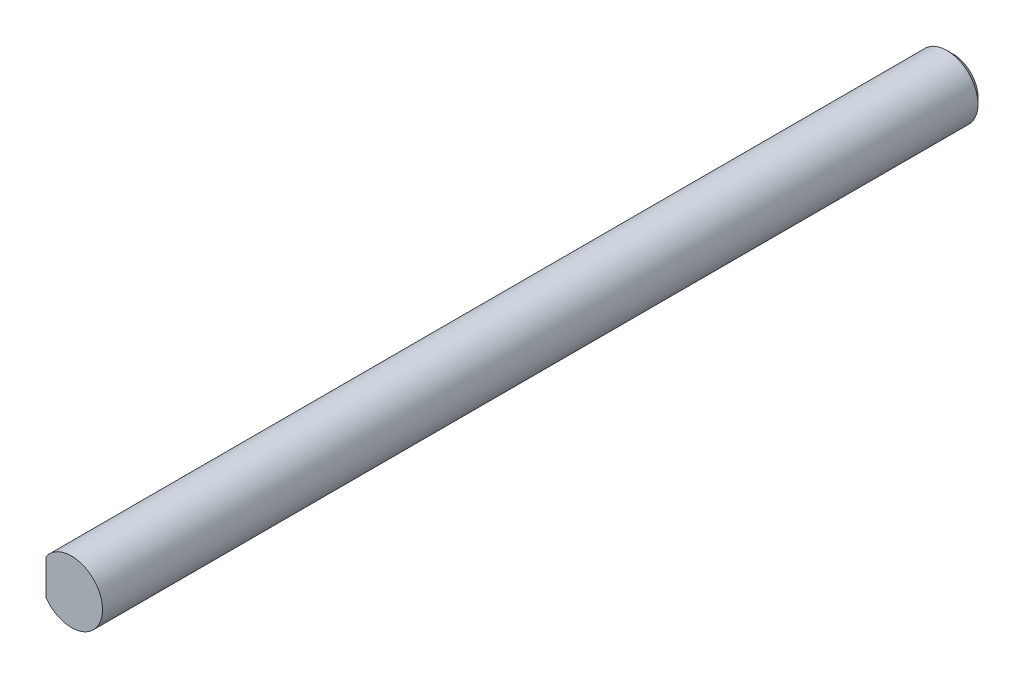
ISO-10303-21;
HEADER;
FILE_DESCRIPTION(('STEP AP214'),'2;1');
FILE_NAME('part.step','',(''),(''),'','','');
FILE_SCHEMA(('AUTOMOTIVE_DESIGN { 1 0 10303 214 1 1 1 1 }'));
ENDSEC;
DATA;
#1=APPLICATION_CONTEXT('core data for automotive mechanical design processes');
#2=APPLICATION_PROTOCOL_DEFINITION('international standard','automotive_design',2000,#1);
#3=PRODUCT_CONTEXT('',#1,'mechanical');
#4=PRODUCT('Part','Part','',(#3));
#5=PRODUCT_RELATED_PRODUCT_CATEGORY('part','',(#4));
#6=PRODUCT_DEFINITION_FORMATION('','',#4);
#7=PRODUCT_DEFINITION_CONTEXT('part definition',#1,'design');
#8=PRODUCT_DEFINITION('design','',#6,#7);
#9=PRODUCT_DEFINITION_SHAPE('','',#8);
#10=(LENGTH_UNIT() NAMED_UNIT(*) SI_UNIT(.MILLI.,.METRE.));
#11=(NAMED_UNIT(*) PLANE_ANGLE_UNIT() SI_UNIT($,.RADIAN.));
#12=(NAMED_UNIT(*) SI_UNIT($,.STERADIAN.) SOLID_ANGLE_UNIT());
#13=UNCERTAINTY_MEASURE_WITH_UNIT(LENGTH_MEASURE(1.E-05),#10,'distance_accuracy_value','');
#14=(GEOMETRIC_REPRESENTATION_CONTEXT(3) GLOBAL_UNCERTAINTY_ASSIGNED_CONTEXT((#13)) GLOBAL_UNIT_ASSIGNED_CONTEXT((#10,
#11,#12)) REPRESENTATION_CONTEXT('',''));
#15=CARTESIAN_POINT('',(0.,0.,0.));
#16=DIRECTION('',(0.,0.,1.));
#17=DIRECTION('',(1.,0.,0.));
#18=AXIS2_PLACEMENT_3D('',#15,#16,#17);
#19=CARTESIAN_POINT('',(0.,0.,71.));
#20=DIRECTION('',(0.,0.,-1.));
#21=DIRECTION('',(-1.,0.,0.));
#22=AXIS2_PLACEMENT_3D('',#19,#20,#21);
#23=CYLINDRICAL_SURFACE('',#22,2.5);
#24=CARTESIAN_POINT('',(0.,0.,0.499999999999987));
#25=DIRECTION('',(0.,0.,1.));
#26=DIRECTION('',(1.,0.,0.));
#27=AXIS2_PLACEMENT_3D('',#24,#25,#26);
#28=CIRCLE('',#27,2.5);
#29=CARTESIAN_POINT('',(2.5,0.,0.499999999999987));
#30=VERTEX_POINT('',#29);
#31=EDGE_CURVE('E51',#30,#30,#28,.T.);
#32=ORIENTED_EDGE('',*,*,#31,.T.);
#33=EDGE_LOOP('',(#32));
#34=FACE_BOUND('',#33,.T.);
#35=CARTESIAN_POINT('',(0.,0.,71.));
#36=DIRECTION('',(0.,0.,1.));
#37=DIRECTION('',(1.,0.,0.));
#38=AXIS2_PLACEMENT_3D('',#35,#36,#37);
#39=CIRCLE('',#38,2.5);
#40=CARTESIAN_POINT('',(-2.05,-1.43090880212542,71.));
#41=VERTEX_POINT('',#40);
#42=CARTESIAN_POINT('',(-2.05,1.43090880212542,71.));
#43=VERTEX_POINT('',#42);
#44=EDGE_CURVE('E79',#41,#43,#39,.T.);
#45=ORIENTED_EDGE('',*,*,#44,.F.);
#46=DIRECTION('',(0.,0.,1.));
#47=VECTOR('',#46,1.);
#48=CARTESIAN_POINT('',(-2.05,-1.43090880212542,57.));
#49=LINE('',#48,#47);
#50=CARTESIAN_POINT('',(-2.05,-1.43090880212542,57.));
#51=VERTEX_POINT('',#50);
#52=EDGE_CURVE('E58',#51,#41,#49,.T.);
#53=ORIENTED_EDGE('',*,*,#52,.F.);
#54=CARTESIAN_POINT('',(0.,0.,57.));
#55=DIRECTION('',(0.,0.,1.));
#56=DIRECTION('',(1.,0.,0.));
#57=AXIS2_PLACEMENT_3D('',#54,#55,#56);
#58=CIRCLE('',#57,2.5);
#59=CARTESIAN_POINT('',(-2.05,1.43090880212542,57.));
#60=VERTEX_POINT('',#59);
#61=EDGE_CURVE('E75',#60,#51,#58,.T.);
#62=ORIENTED_EDGE('',*,*,#61,.F.);
#63=DIRECTION('',(0.,0.,1.));
#64=VECTOR('',#63,1.);
#65=CARTESIAN_POINT('',(-2.05,1.43090880212542,57.));
#66=LINE('',#65,#64);
#67=EDGE_CURVE('E64',#60,#43,#66,.T.);
#68=ORIENTED_EDGE('',*,*,#67,.T.);
#69=EDGE_LOOP('',(#45,#53,#62,#68));
#70=FACE_BOUND('',#69,.T.);
#71=ADVANCED_FACE('F41',(#34,#70),#23,.T.);
#72=CARTESIAN_POINT('',(0.,0.,71.));
#73=DIRECTION('',(0.,0.,1.));
#74=DIRECTION('',(1.,0.,0.));
#75=AXIS2_PLACEMENT_3D('',#72,#73,#74);
#76=PLANE('',#75);
#77=DIRECTION('',(0.,1.,0.));
#78=VECTOR('',#77,1.);
#79=CARTESIAN_POINT('',(-2.05,1.43090880212542,71.));
#80=LINE('',#79,#78);
#81=EDGE_CURVE('E69',#41,#43,#80,.T.);
#82=ORIENTED_EDGE('',*,*,#81,.F.);
#83=ORIENTED_EDGE('',*,*,#44,.T.);
#84=EDGE_LOOP('',(#82,#83));
#85=FACE_BOUND('',#84,.T.);
#86=ADVANCED_FACE('F82',(#85),#76,.T.);
#87=CARTESIAN_POINT('',(0.,0.,0.));
#88=DIRECTION('',(0.,0.,1.));
#89=DIRECTION('',(1.,0.,0.));
#90=AXIS2_PLACEMENT_3D('',#87,#88,#89);
#91=PLANE('',#90);
#92=CARTESIAN_POINT('',(0.,0.,0.));
#93=DIRECTION('',(0.,0.,1.));
#94=DIRECTION('',(1.,0.,0.));
#95=AXIS2_PLACEMENT_3D('',#92,#93,#94);
#96=CIRCLE('',#95,2.00000000000001);
#97=CARTESIAN_POINT('',(2.00000000000001,0.,0.));
#98=VERTEX_POINT('',#97);
#99=EDGE_CURVE('E11',#98,#98,#96,.F.);
#100=ORIENTED_EDGE('',*,*,#99,.T.);
#101=EDGE_LOOP('',(#100));
#102=FACE_BOUND('',#101,.T.);
#103=ADVANCED_FACE('F103',(#102),#91,.F.);
#104=CARTESIAN_POINT('',(-2.05,1.43090880212542,57.));
#105=DIRECTION('',(1.,0.,0.));
#106=DIRECTION('',(0.,0.,-1.));
#107=AXIS2_PLACEMENT_3D('',#104,#105,#106);
#108=PLANE('',#107);
#109=ORIENTED_EDGE('',*,*,#81,.T.);
#110=ORIENTED_EDGE('',*,*,#67,.F.);
#111=DIRECTION('',(0.,1.,0.));
#112=VECTOR('',#111,1.);
#113=CARTESIAN_POINT('',(-2.05,1.43090880212542,57.));
#114=LINE('',#113,#112);
#115=EDGE_CURVE('E89',#51,#60,#114,.T.);
#116=ORIENTED_EDGE('',*,*,#115,.F.);
#117=ORIENTED_EDGE('',*,*,#52,.T.);
#118=EDGE_LOOP('',(#109,#110,#116,#117));
#119=FACE_BOUND('',#118,.T.);
#120=ADVANCED_FACE('F70',(#119),#108,.F.);
#121=CARTESIAN_POINT('',(0.,0.,57.));
#122=DIRECTION('',(0.,0.,1.));
#123=DIRECTION('',(1.,0.,0.));
#124=AXIS2_PLACEMENT_3D('',#121,#122,#123);
#125=PLANE('',#124);
#126=ORIENTED_EDGE('',*,*,#61,.T.);
#127=ORIENTED_EDGE('',*,*,#115,.T.);
#128=EDGE_LOOP('',(#126,#127));
#129=FACE_BOUND('',#128,.T.);
#130=ADVANCED_FACE('F95',(#129),#125,.T.);
#131=CARTESIAN_POINT('',(0.,0.,0.499999999999987));
#132=DIRECTION('',(0.,0.,1.));
#133=DIRECTION('',(1.,0.,0.));
#134=AXIS2_PLACEMENT_3D('',#131,#132,#133);
#135=CONICAL_SURFACE('',#134,2.5,0.785398163397454);
#136=ORIENTED_EDGE('',*,*,#99,.F.);
#137=EDGE_LOOP('',(#136));
#138=FACE_BOUND('',#137,.T.);
#139=ORIENTED_EDGE('',*,*,#31,.F.);
#140=EDGE_LOOP('',(#139));
#141=FACE_BOUND('',#140,.T.);
#142=ADVANCED_FACE('F44',(#138,#141),#135,.T.);
#143=CLOSED_SHELL('',(#71,#86,#103,#120,#130,#142));
#144=MANIFOLD_SOLID_BREP('B2',#143);
#145=ADVANCED_BREP_SHAPE_REPRESENTATION('',(#18,#144),#14);
#146=SHAPE_DEFINITION_REPRESENTATION(#9,#145);
ENDSEC;
END-ISO-10303-21;
